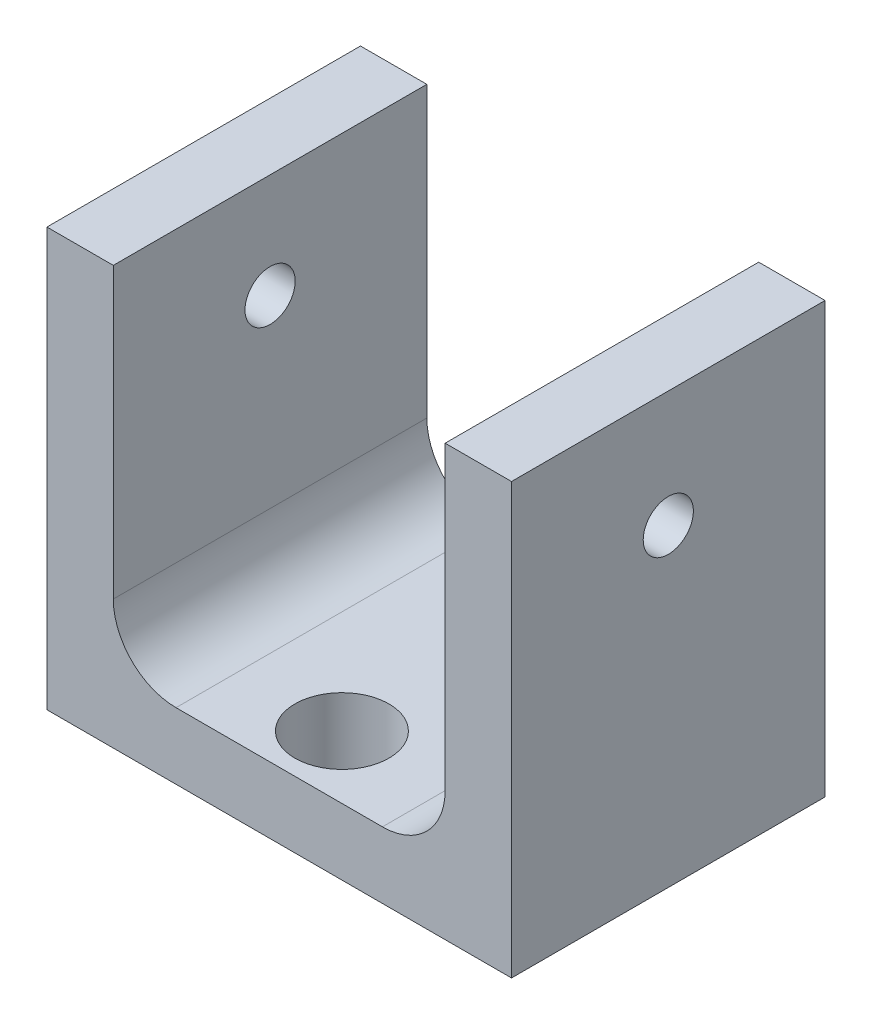
ISO-10303-21;
HEADER;
FILE_DESCRIPTION(('STEP AP214'),'2;1');
FILE_NAME('part.step','',(''),(''),'','','');
FILE_SCHEMA(('AUTOMOTIVE_DESIGN { 1 0 10303 214 1 1 1 1 }'));
ENDSEC;
DATA;
#1=APPLICATION_CONTEXT('core data for automotive mechanical design processes');
#2=APPLICATION_PROTOCOL_DEFINITION('international standard','automotive_design',2000,#1);
#3=PRODUCT_CONTEXT('',#1,'mechanical');
#4=PRODUCT('Part','Part','',(#3));
#5=PRODUCT_RELATED_PRODUCT_CATEGORY('part','',(#4));
#6=PRODUCT_DEFINITION_FORMATION('','',#4);
#7=PRODUCT_DEFINITION_CONTEXT('part definition',#1,'design');
#8=PRODUCT_DEFINITION('design','',#6,#7);
#9=PRODUCT_DEFINITION_SHAPE('','',#8);
#10=(LENGTH_UNIT() NAMED_UNIT(*) SI_UNIT(.MILLI.,.METRE.));
#11=(NAMED_UNIT(*) PLANE_ANGLE_UNIT() SI_UNIT($,.RADIAN.));
#12=(NAMED_UNIT(*) SI_UNIT($,.STERADIAN.) SOLID_ANGLE_UNIT());
#13=UNCERTAINTY_MEASURE_WITH_UNIT(LENGTH_MEASURE(1.E-05),#10,'distance_accuracy_value','');
#14=(GEOMETRIC_REPRESENTATION_CONTEXT(3) GLOBAL_UNCERTAINTY_ASSIGNED_CONTEXT((#13)) GLOBAL_UNIT_ASSIGNED_CONTEXT((#10,
#11,#12)) REPRESENTATION_CONTEXT('',''));
#15=CARTESIAN_POINT('',(0.,0.,0.));
#16=DIRECTION('',(0.,0.,1.));
#17=DIRECTION('',(1.,0.,0.));
#18=AXIS2_PLACEMENT_3D('',#15,#16,#17);
#19=CARTESIAN_POINT('',(0.,20.,7.5));
#20=DIRECTION('',(1.,0.,0.));
#21=DIRECTION('',(0.,1.,0.));
#22=AXIS2_PLACEMENT_3D('',#19,#20,#21);
#23=PLANE('',#22);
#24=CARTESIAN_POINT('',(0.,15.,0.));
#25=DIRECTION('',(-1.,0.,0.));
#26=DIRECTION('',(0.,0.,1.));
#27=AXIS2_PLACEMENT_3D('',#24,#25,#26);
#28=CIRCLE('',#27,1.2);
#29=CARTESIAN_POINT('',(0.,15.,1.2));
#30=VERTEX_POINT('',#29);
#31=EDGE_CURVE('E276',#30,#30,#28,.T.);
#32=ORIENTED_EDGE('',*,*,#31,.F.);
#33=EDGE_LOOP('',(#32));
#34=FACE_BOUND('',#33,.T.);
#35=DIRECTION('',(0.,-1.,0.));
#36=VECTOR('',#35,1.);
#37=CARTESIAN_POINT('',(0.,20.,-7.5));
#38=LINE('',#37,#36);
#39=CARTESIAN_POINT('',(0.,20.,-7.5));
#40=VERTEX_POINT('',#39);
#41=CARTESIAN_POINT('',(0.,0.,-7.5));
#42=VERTEX_POINT('',#41);
#43=EDGE_CURVE('E158',#40,#42,#38,.T.);
#44=ORIENTED_EDGE('',*,*,#43,.T.);
#45=DIRECTION('',(0.,0.,-1.));
#46=VECTOR('',#45,1.);
#47=CARTESIAN_POINT('',(0.,0.,7.5));
#48=LINE('',#47,#46);
#49=CARTESIAN_POINT('',(0.,0.,7.5));
#50=VERTEX_POINT('',#49);
#51=EDGE_CURVE('E11',#50,#42,#48,.T.);
#52=ORIENTED_EDGE('',*,*,#51,.F.);
#53=DIRECTION('',(0.,-1.,0.));
#54=VECTOR('',#53,1.);
#55=CARTESIAN_POINT('',(0.,20.,7.5));
#56=LINE('',#55,#54);
#57=CARTESIAN_POINT('',(0.,20.,7.5));
#58=VERTEX_POINT('',#57);
#59=EDGE_CURVE('E187',#58,#50,#56,.T.);
#60=ORIENTED_EDGE('',*,*,#59,.F.);
#61=DIRECTION('',(0.,0.,-1.));
#62=VECTOR('',#61,1.);
#63=CARTESIAN_POINT('',(0.,20.,7.5));
#64=LINE('',#63,#62);
#65=EDGE_CURVE('E154',#58,#40,#64,.T.);
#66=ORIENTED_EDGE('',*,*,#65,.T.);
#67=EDGE_LOOP('',(#44,#52,#60,#66));
#68=FACE_BOUND('',#67,.T.);
#69=ADVANCED_FACE('F45',(#34,#68),#23,.F.);
#70=CARTESIAN_POINT('',(0.,0.,7.5));
#71=DIRECTION('',(0.,1.,0.));
#72=DIRECTION('',(0.,0.,1.));
#73=AXIS2_PLACEMENT_3D('',#70,#71,#72);
#74=PLANE('',#73);
#75=CARTESIAN_POINT('',(11.1125,0.,4.5));
#76=DIRECTION('',(0.,1.,0.));
#77=DIRECTION('',(0.,0.,1.));
#78=AXIS2_PLACEMENT_3D('',#75,#76,#77);
#79=CIRCLE('',#78,2.24999999999999);
#80=CARTESIAN_POINT('',(11.1125,0.,6.74999999999999));
#81=VERTEX_POINT('',#80);
#82=EDGE_CURVE('E256',#81,#81,#79,.T.);
#83=ORIENTED_EDGE('',*,*,#82,.T.);
#84=EDGE_LOOP('',(#83));
#85=FACE_BOUND('',#84,.T.);
#86=CARTESIAN_POINT('',(11.1125,0.,-4.5));
#87=DIRECTION('',(0.,1.,0.));
#88=DIRECTION('',(0.,0.,1.));
#89=AXIS2_PLACEMENT_3D('',#86,#87,#88);
#90=CIRCLE('',#89,2.24999999999999);
#91=CARTESIAN_POINT('',(11.1125,0.,-2.25000000000001));
#92=VERTEX_POINT('',#91);
#93=EDGE_CURVE('E163',#92,#92,#90,.T.);
#94=ORIENTED_EDGE('',*,*,#93,.T.);
#95=EDGE_LOOP('',(#94));
#96=FACE_BOUND('',#95,.T.);
#97=DIRECTION('',(1.,0.,0.));
#98=VECTOR('',#97,1.);
#99=CARTESIAN_POINT('',(0.,0.,-7.5));
#100=LINE('',#99,#98);
#101=CARTESIAN_POINT('',(22.225,0.,-7.5));
#102=VERTEX_POINT('',#101);
#103=EDGE_CURVE('E162',#42,#102,#100,.T.);
#104=ORIENTED_EDGE('',*,*,#103,.T.);
#105=DIRECTION('',(0.,0.,-1.));
#106=VECTOR('',#105,1.);
#107=CARTESIAN_POINT('',(22.225,0.,7.5));
#108=LINE('',#107,#106);
#109=CARTESIAN_POINT('',(22.225,0.,7.5));
#110=VERTEX_POINT('',#109);
#111=EDGE_CURVE('E54',#110,#102,#108,.T.);
#112=ORIENTED_EDGE('',*,*,#111,.F.);
#113=DIRECTION('',(1.,0.,0.));
#114=VECTOR('',#113,1.);
#115=CARTESIAN_POINT('',(0.,0.,7.5));
#116=LINE('',#115,#114);
#117=EDGE_CURVE('E111',#50,#110,#116,.T.);
#118=ORIENTED_EDGE('',*,*,#117,.F.);
#119=ORIENTED_EDGE('',*,*,#51,.T.);
#120=EDGE_LOOP('',(#104,#112,#118,#119));
#121=FACE_BOUND('',#120,.T.);
#122=ADVANCED_FACE('F286',(#85,#96,#121),#74,.F.);
#123=CARTESIAN_POINT('',(22.225,0.,7.5));
#124=DIRECTION('',(-1.,0.,0.));
#125=DIRECTION('',(0.,0.,1.));
#126=AXIS2_PLACEMENT_3D('',#123,#124,#125);
#127=PLANE('',#126);
#128=CARTESIAN_POINT('',(22.225,15.,0.));
#129=DIRECTION('',(-1.,0.,0.));
#130=DIRECTION('',(0.,0.,1.));
#131=AXIS2_PLACEMENT_3D('',#128,#129,#130);
#132=CIRCLE('',#131,1.2);
#133=CARTESIAN_POINT('',(22.225,15.,1.2));
#134=VERTEX_POINT('',#133);
#135=EDGE_CURVE('E272',#134,#134,#132,.T.);
#136=ORIENTED_EDGE('',*,*,#135,.T.);
#137=EDGE_LOOP('',(#136));
#138=FACE_BOUND('',#137,.T.);
#139=DIRECTION('',(0.,1.,0.));
#140=VECTOR('',#139,1.);
#141=CARTESIAN_POINT('',(22.225,0.,-7.5));
#142=LINE('',#141,#140);
#143=CARTESIAN_POINT('',(22.225,20.5699468085106,-7.5));
#144=VERTEX_POINT('',#143);
#145=EDGE_CURVE('E166',#102,#144,#142,.T.);
#146=ORIENTED_EDGE('',*,*,#145,.T.);
#147=DIRECTION('',(0.,0.,-1.));
#148=VECTOR('',#147,1.);
#149=CARTESIAN_POINT('',(22.225,20.5699468085106,7.5));
#150=LINE('',#149,#148);
#151=CARTESIAN_POINT('',(22.225,20.5699468085106,7.5));
#152=VERTEX_POINT('',#151);
#153=EDGE_CURVE('E206',#152,#144,#150,.T.);
#154=ORIENTED_EDGE('',*,*,#153,.F.);
#155=DIRECTION('',(0.,1.,0.));
#156=VECTOR('',#155,1.);
#157=CARTESIAN_POINT('',(22.225,0.,7.5));
#158=LINE('',#157,#156);
#159=EDGE_CURVE('E216',#110,#152,#158,.T.);
#160=ORIENTED_EDGE('',*,*,#159,.F.);
#161=ORIENTED_EDGE('',*,*,#111,.T.);
#162=EDGE_LOOP('',(#146,#154,#160,#161));
#163=FACE_BOUND('',#162,.T.);
#164=ADVANCED_FACE('F214',(#138,#163),#127,.F.);
#165=CARTESIAN_POINT('',(22.225,20.5699468085106,7.5));
#166=DIRECTION('',(0.,-1.,0.));
#167=DIRECTION('',(1.,0.,0.));
#168=AXIS2_PLACEMENT_3D('',#165,#166,#167);
#169=PLANE('',#168);
#170=DIRECTION('',(-1.,0.,0.));
#171=VECTOR('',#170,1.);
#172=CARTESIAN_POINT('',(22.225,20.5699468085106,-7.5));
#173=LINE('',#172,#171);
#174=CARTESIAN_POINT('',(19.05,20.5699468085107,-7.5));
#175=VERTEX_POINT('',#174);
#176=EDGE_CURVE('E169',#144,#175,#173,.T.);
#177=ORIENTED_EDGE('',*,*,#176,.T.);
#178=DIRECTION('',(0.,0.,-1.));
#179=VECTOR('',#178,1.);
#180=CARTESIAN_POINT('',(19.05,20.5699468085107,7.5));
#181=LINE('',#180,#179);
#182=CARTESIAN_POINT('',(19.05,20.5699468085107,7.5));
#183=VERTEX_POINT('',#182);
#184=EDGE_CURVE('E202',#183,#175,#181,.T.);
#185=ORIENTED_EDGE('',*,*,#184,.F.);
#186=DIRECTION('',(-1.,0.,0.));
#187=VECTOR('',#186,1.);
#188=CARTESIAN_POINT('',(22.225,20.5699468085106,7.5));
#189=LINE('',#188,#187);
#190=EDGE_CURVE('E235',#152,#183,#189,.T.);
#191=ORIENTED_EDGE('',*,*,#190,.F.);
#192=ORIENTED_EDGE('',*,*,#153,.T.);
#193=EDGE_LOOP('',(#177,#185,#191,#192));
#194=FACE_BOUND('',#193,.T.);
#195=ADVANCED_FACE('F225',(#194),#169,.F.);
#196=CARTESIAN_POINT('',(19.05,20.5699468085107,7.5));
#197=DIRECTION('',(1.,0.,0.));
#198=DIRECTION('',(0.,1.,0.));
#199=AXIS2_PLACEMENT_3D('',#196,#197,#198);
#200=PLANE('',#199);
#201=CARTESIAN_POINT('',(19.05,15.,0.));
#202=DIRECTION('',(1.,0.,0.));
#203=DIRECTION('',(0.,1.,0.));
#204=AXIS2_PLACEMENT_3D('',#201,#202,#203);
#205=CIRCLE('',#204,1.2);
#206=CARTESIAN_POINT('',(19.05,16.2,0.));
#207=VERTEX_POINT('',#206);
#208=EDGE_CURVE('E264',#207,#207,#205,.T.);
#209=ORIENTED_EDGE('',*,*,#208,.T.);
#210=EDGE_LOOP('',(#209));
#211=FACE_BOUND('',#210,.T.);
#212=DIRECTION('',(0.,-1.,0.));
#213=VECTOR('',#212,1.);
#214=CARTESIAN_POINT('',(19.05,20.5699468085107,-7.5));
#215=LINE('',#214,#213);
#216=CARTESIAN_POINT('',(19.05,6.17500000000002,-7.5));
#217=VERTEX_POINT('',#216);
#218=EDGE_CURVE('E172',#175,#217,#215,.T.);
#219=ORIENTED_EDGE('',*,*,#218,.T.);
#220=DIRECTION('',(0.,0.,-1.));
#221=VECTOR('',#220,1.);
#222=CARTESIAN_POINT('',(19.05,6.17500000000002,7.5));
#223=LINE('',#222,#221);
#224=CARTESIAN_POINT('',(19.05,6.17500000000002,7.5));
#225=VERTEX_POINT('',#224);
#226=EDGE_CURVE('E198',#225,#217,#223,.T.);
#227=ORIENTED_EDGE('',*,*,#226,.F.);
#228=DIRECTION('',(0.,-1.,0.));
#229=VECTOR('',#228,1.);
#230=CARTESIAN_POINT('',(19.05,20.5699468085107,7.5));
#231=LINE('',#230,#229);
#232=EDGE_CURVE('E231',#183,#225,#231,.T.);
#233=ORIENTED_EDGE('',*,*,#232,.F.);
#234=ORIENTED_EDGE('',*,*,#184,.T.);
#235=EDGE_LOOP('',(#219,#227,#233,#234));
#236=FACE_BOUND('',#235,.T.);
#237=ADVANCED_FACE('F229',(#211,#236),#200,.F.);
#238=CARTESIAN_POINT('',(16.05,6.175,7.5));
#239=DIRECTION('',(0.,0.,-1.));
#240=DIRECTION('',(-1.,0.,0.));
#241=AXIS2_PLACEMENT_3D('',#238,#239,#240);
#242=CYLINDRICAL_SURFACE('',#241,3.);
#243=CARTESIAN_POINT('',(16.05,6.175,-7.5));
#244=DIRECTION('',(0.,0.,-1.));
#245=DIRECTION('',(-1.,0.,0.));
#246=AXIS2_PLACEMENT_3D('',#243,#244,#245);
#247=CIRCLE('',#246,3.);
#248=CARTESIAN_POINT('',(16.05,3.175,-7.5));
#249=VERTEX_POINT('',#248);
#250=EDGE_CURVE('E175',#217,#249,#247,.T.);
#251=ORIENTED_EDGE('',*,*,#250,.T.);
#252=DIRECTION('',(0.,0.,-1.));
#253=VECTOR('',#252,1.);
#254=CARTESIAN_POINT('',(16.05,3.175,7.5));
#255=LINE('',#254,#253);
#256=CARTESIAN_POINT('',(16.05,3.175,7.5));
#257=VERTEX_POINT('',#256);
#258=EDGE_CURVE('E194',#257,#249,#255,.T.);
#259=ORIENTED_EDGE('',*,*,#258,.F.);
#260=CARTESIAN_POINT('',(16.05,6.175,7.5));
#261=DIRECTION('',(0.,0.,-1.));
#262=DIRECTION('',(-1.,0.,0.));
#263=AXIS2_PLACEMENT_3D('',#260,#261,#262);
#264=CIRCLE('',#263,3.);
#265=EDGE_CURVE('E234',#225,#257,#264,.T.);
#266=ORIENTED_EDGE('',*,*,#265,.F.);
#267=ORIENTED_EDGE('',*,*,#226,.T.);
#268=EDGE_LOOP('',(#251,#259,#266,#267));
#269=FACE_BOUND('',#268,.T.);
#270=ADVANCED_FACE('F294',(#269),#242,.F.);
#271=CARTESIAN_POINT('',(16.05,3.175,7.5));
#272=DIRECTION('',(0.,-1.,0.));
#273=DIRECTION('',(1.,0.,0.));
#274=AXIS2_PLACEMENT_3D('',#271,#272,#273);
#275=PLANE('',#274);
#276=CARTESIAN_POINT('',(11.1125,3.175,4.5));
#277=DIRECTION('',(0.,1.,0.));
#278=DIRECTION('',(0.,0.,1.));
#279=AXIS2_PLACEMENT_3D('',#276,#277,#278);
#280=CIRCLE('',#279,2.24999999999999);
#281=CARTESIAN_POINT('',(11.1125,3.175,6.74999999999999));
#282=VERTEX_POINT('',#281);
#283=EDGE_CURVE('E260',#282,#282,#280,.T.);
#284=ORIENTED_EDGE('',*,*,#283,.F.);
#285=EDGE_LOOP('',(#284));
#286=FACE_BOUND('',#285,.T.);
#287=CARTESIAN_POINT('',(11.1125,3.175,-4.5));
#288=DIRECTION('',(0.,1.,0.));
#289=DIRECTION('',(0.,0.,1.));
#290=AXIS2_PLACEMENT_3D('',#287,#288,#289);
#291=CIRCLE('',#290,2.24999999999999);
#292=CARTESIAN_POINT('',(11.1125,3.175,-2.25000000000001));
#293=VERTEX_POINT('',#292);
#294=EDGE_CURVE('E252',#293,#293,#291,.T.);
#295=ORIENTED_EDGE('',*,*,#294,.F.);
#296=EDGE_LOOP('',(#295));
#297=FACE_BOUND('',#296,.T.);
#298=DIRECTION('',(-1.,0.,0.));
#299=VECTOR('',#298,1.);
#300=CARTESIAN_POINT('',(16.05,3.175,-7.5));
#301=LINE('',#300,#299);
#302=CARTESIAN_POINT('',(6.17500000000002,3.175,-7.5));
#303=VERTEX_POINT('',#302);
#304=EDGE_CURVE('E178',#249,#303,#301,.T.);
#305=ORIENTED_EDGE('',*,*,#304,.T.);
#306=DIRECTION('',(0.,0.,-1.));
#307=VECTOR('',#306,1.);
#308=CARTESIAN_POINT('',(6.17500000000002,3.175,7.5));
#309=LINE('',#308,#307);
#310=CARTESIAN_POINT('',(6.17500000000002,3.175,7.5));
#311=VERTEX_POINT('',#310);
#312=EDGE_CURVE('E147',#311,#303,#309,.T.);
#313=ORIENTED_EDGE('',*,*,#312,.F.);
#314=DIRECTION('',(-1.,0.,0.));
#315=VECTOR('',#314,1.);
#316=CARTESIAN_POINT('',(16.05,3.175,7.5));
#317=LINE('',#316,#315);
#318=EDGE_CURVE('E136',#257,#311,#317,.T.);
#319=ORIENTED_EDGE('',*,*,#318,.F.);
#320=ORIENTED_EDGE('',*,*,#258,.T.);
#321=EDGE_LOOP('',(#305,#313,#319,#320));
#322=FACE_BOUND('',#321,.T.);
#323=ADVANCED_FACE('F291',(#286,#297,#322),#275,.F.);
#324=CARTESIAN_POINT('',(6.175,6.175,7.5));
#325=DIRECTION('',(0.,0.,-1.));
#326=DIRECTION('',(-1.,0.,0.));
#327=AXIS2_PLACEMENT_3D('',#324,#325,#326);
#328=CYLINDRICAL_SURFACE('',#327,3.);
#329=CARTESIAN_POINT('',(6.175,6.175,-7.5));
#330=DIRECTION('',(0.,0.,-1.));
#331=DIRECTION('',(-1.,0.,0.));
#332=AXIS2_PLACEMENT_3D('',#329,#330,#331);
#333=CIRCLE('',#332,3.);
#334=CARTESIAN_POINT('',(3.175,6.175,-7.5));
#335=VERTEX_POINT('',#334);
#336=EDGE_CURVE('E145',#303,#335,#333,.T.);
#337=ORIENTED_EDGE('',*,*,#336,.T.);
#338=DIRECTION('',(0.,0.,-1.));
#339=VECTOR('',#338,1.);
#340=CARTESIAN_POINT('',(3.175,6.175,7.5));
#341=LINE('',#340,#339);
#342=CARTESIAN_POINT('',(3.175,6.175,7.5));
#343=VERTEX_POINT('',#342);
#344=EDGE_CURVE('E142',#343,#335,#341,.T.);
#345=ORIENTED_EDGE('',*,*,#344,.F.);
#346=CARTESIAN_POINT('',(6.175,6.175,7.5));
#347=DIRECTION('',(0.,0.,-1.));
#348=DIRECTION('',(-1.,0.,0.));
#349=AXIS2_PLACEMENT_3D('',#346,#347,#348);
#350=CIRCLE('',#349,3.);
#351=EDGE_CURVE('E130',#311,#343,#350,.T.);
#352=ORIENTED_EDGE('',*,*,#351,.F.);
#353=ORIENTED_EDGE('',*,*,#312,.T.);
#354=EDGE_LOOP('',(#337,#345,#352,#353));
#355=FACE_BOUND('',#354,.T.);
#356=ADVANCED_FACE('F143',(#355),#328,.F.);
#357=CARTESIAN_POINT('',(3.175,6.17500000000002,7.5));
#358=DIRECTION('',(-1.,0.,0.));
#359=DIRECTION('',(0.,0.,1.));
#360=AXIS2_PLACEMENT_3D('',#357,#358,#359);
#361=PLANE('',#360);
#362=CARTESIAN_POINT('',(3.175,15.,0.));
#363=DIRECTION('',(-1.,0.,0.));
#364=DIRECTION('',(0.,0.,1.));
#365=AXIS2_PLACEMENT_3D('',#362,#363,#364);
#366=CIRCLE('',#365,1.2);
#367=CARTESIAN_POINT('',(3.175,15.,1.2));
#368=VERTEX_POINT('',#367);
#369=EDGE_CURVE('E268',#368,#368,#366,.T.);
#370=ORIENTED_EDGE('',*,*,#369,.T.);
#371=EDGE_LOOP('',(#370));
#372=FACE_BOUND('',#371,.T.);
#373=DIRECTION('',(0.,1.,0.));
#374=VECTOR('',#373,1.);
#375=CARTESIAN_POINT('',(3.175,6.17500000000002,-7.5));
#376=LINE('',#375,#374);
#377=CARTESIAN_POINT('',(3.175,20.,-7.5));
#378=VERTEX_POINT('',#377);
#379=EDGE_CURVE('E97',#335,#378,#376,.T.);
#380=ORIENTED_EDGE('',*,*,#379,.T.);
#381=DIRECTION('',(0.,0.,-1.));
#382=VECTOR('',#381,1.);
#383=CARTESIAN_POINT('',(3.175,20.,7.5));
#384=LINE('',#383,#382);
#385=CARTESIAN_POINT('',(3.175,20.,7.5));
#386=VERTEX_POINT('',#385);
#387=EDGE_CURVE('E148',#386,#378,#384,.T.);
#388=ORIENTED_EDGE('',*,*,#387,.F.);
#389=DIRECTION('',(0.,1.,0.));
#390=VECTOR('',#389,1.);
#391=CARTESIAN_POINT('',(3.175,6.17500000000002,7.5));
#392=LINE('',#391,#390);
#393=EDGE_CURVE('E134',#343,#386,#392,.T.);
#394=ORIENTED_EDGE('',*,*,#393,.F.);
#395=ORIENTED_EDGE('',*,*,#344,.T.);
#396=EDGE_LOOP('',(#380,#388,#394,#395));
#397=FACE_BOUND('',#396,.T.);
#398=ADVANCED_FACE('F150',(#372,#397),#361,.F.);
#399=CARTESIAN_POINT('',(3.175,20.,7.5));
#400=DIRECTION('',(0.,-1.,0.));
#401=DIRECTION('',(0.,0.,-1.));
#402=AXIS2_PLACEMENT_3D('',#399,#400,#401);
#403=PLANE('',#402);
#404=DIRECTION('',(-1.,0.,0.));
#405=VECTOR('',#404,1.);
#406=CARTESIAN_POINT('',(3.175,20.,-7.5));
#407=LINE('',#406,#405);
#408=EDGE_CURVE('E103',#378,#40,#407,.T.);
#409=ORIENTED_EDGE('',*,*,#408,.T.);
#410=ORIENTED_EDGE('',*,*,#65,.F.);
#411=DIRECTION('',(-1.,0.,0.));
#412=VECTOR('',#411,1.);
#413=CARTESIAN_POINT('',(3.175,20.,7.5));
#414=LINE('',#413,#412);
#415=EDGE_CURVE('E62',#386,#58,#414,.T.);
#416=ORIENTED_EDGE('',*,*,#415,.F.);
#417=ORIENTED_EDGE('',*,*,#387,.T.);
#418=EDGE_LOOP('',(#409,#410,#416,#417));
#419=FACE_BOUND('',#418,.T.);
#420=ADVANCED_FACE('F338',(#419),#403,.F.);
#421=CARTESIAN_POINT('',(16.05,6.175,7.5));
#422=DIRECTION('',(0.,0.,-1.));
#423=DIRECTION('',(-1.,0.,0.));
#424=AXIS2_PLACEMENT_3D('',#421,#422,#423);
#425=PLANE('',#424);
#426=ORIENTED_EDGE('',*,*,#59,.T.);
#427=ORIENTED_EDGE('',*,*,#117,.T.);
#428=ORIENTED_EDGE('',*,*,#159,.T.);
#429=ORIENTED_EDGE('',*,*,#190,.T.);
#430=ORIENTED_EDGE('',*,*,#232,.T.);
#431=ORIENTED_EDGE('',*,*,#265,.T.);
#432=ORIENTED_EDGE('',*,*,#318,.T.);
#433=ORIENTED_EDGE('',*,*,#351,.T.);
#434=ORIENTED_EDGE('',*,*,#393,.T.);
#435=ORIENTED_EDGE('',*,*,#415,.T.);
#436=EDGE_LOOP('',(#426,#427,#428,#429,#430,#431,#432,#433,#434,#435));
#437=FACE_BOUND('',#436,.T.);
#438=ADVANCED_FACE('F132',(#437),#425,.F.);
#439=CARTESIAN_POINT('',(16.05,6.175,-7.5));
#440=DIRECTION('',(0.,0.,-1.));
#441=DIRECTION('',(-1.,0.,0.));
#442=AXIS2_PLACEMENT_3D('',#439,#440,#441);
#443=PLANE('',#442);
#444=ORIENTED_EDGE('',*,*,#43,.F.);
#445=ORIENTED_EDGE('',*,*,#408,.F.);
#446=ORIENTED_EDGE('',*,*,#379,.F.);
#447=ORIENTED_EDGE('',*,*,#336,.F.);
#448=ORIENTED_EDGE('',*,*,#304,.F.);
#449=ORIENTED_EDGE('',*,*,#250,.F.);
#450=ORIENTED_EDGE('',*,*,#218,.F.);
#451=ORIENTED_EDGE('',*,*,#176,.F.);
#452=ORIENTED_EDGE('',*,*,#145,.F.);
#453=ORIENTED_EDGE('',*,*,#103,.F.);
#454=EDGE_LOOP('',(#444,#445,#446,#447,#448,#449,#450,#451,#452,#453));
#455=FACE_BOUND('',#454,.T.);
#456=ADVANCED_FACE('F220',(#455),#443,.T.);
#457=CARTESIAN_POINT('',(11.1125,3.175,-4.5));
#458=DIRECTION('',(0.,1.,0.));
#459=DIRECTION('',(0.,0.,1.));
#460=AXIS2_PLACEMENT_3D('',#457,#458,#459);
#461=CYLINDRICAL_SURFACE('',#460,2.24999999999999);
#462=ORIENTED_EDGE('',*,*,#93,.F.);
#463=EDGE_LOOP('',(#462));
#464=FACE_BOUND('',#463,.T.);
#465=ORIENTED_EDGE('',*,*,#294,.T.);
#466=EDGE_LOOP('',(#465));
#467=FACE_BOUND('',#466,.T.);
#468=ADVANCED_FACE('F321',(#464,#467),#461,.F.);
#469=CARTESIAN_POINT('',(11.1125,3.175,4.5));
#470=DIRECTION('',(0.,1.,0.));
#471=DIRECTION('',(0.,0.,1.));
#472=AXIS2_PLACEMENT_3D('',#469,#470,#471);
#473=CYLINDRICAL_SURFACE('',#472,2.24999999999999);
#474=ORIENTED_EDGE('',*,*,#82,.F.);
#475=EDGE_LOOP('',(#474));
#476=FACE_BOUND('',#475,.T.);
#477=ORIENTED_EDGE('',*,*,#283,.T.);
#478=EDGE_LOOP('',(#477));
#479=FACE_BOUND('',#478,.T.);
#480=ADVANCED_FACE('F324',(#476,#479),#473,.F.);
#481=CARTESIAN_POINT('',(0.,15.,0.));
#482=DIRECTION('',(-1.,0.,0.));
#483=DIRECTION('',(0.,0.,1.));
#484=AXIS2_PLACEMENT_3D('',#481,#482,#483);
#485=CYLINDRICAL_SURFACE('',#484,1.2);
#486=ORIENTED_EDGE('',*,*,#135,.F.);
#487=EDGE_LOOP('',(#486));
#488=FACE_BOUND('',#487,.T.);
#489=ORIENTED_EDGE('',*,*,#208,.F.);
#490=EDGE_LOOP('',(#489));
#491=FACE_BOUND('',#490,.T.);
#492=ADVANCED_FACE('F331',(#488,#491),#485,.F.);
#493=ORIENTED_EDGE('',*,*,#31,.T.);
#494=EDGE_LOOP('',(#493));
#495=FACE_BOUND('',#494,.T.);
#496=ORIENTED_EDGE('',*,*,#369,.F.);
#497=EDGE_LOOP('',(#496));
#498=FACE_BOUND('',#497,.T.);
#499=ADVANCED_FACE('F281',(#495,#498),#485,.F.);
#500=CLOSED_SHELL('',(#69,#122,#164,#195,#237,#270,#323,#356,#398,#420,#438,#456,#468,#480,#492,#499));
#501=MANIFOLD_SOLID_BREP('B2',#500);
#502=ADVANCED_BREP_SHAPE_REPRESENTATION('',(#18,#501),#14);
#503=SHAPE_DEFINITION_REPRESENTATION(#9,#502);
ENDSEC;
END-ISO-10303-21;
